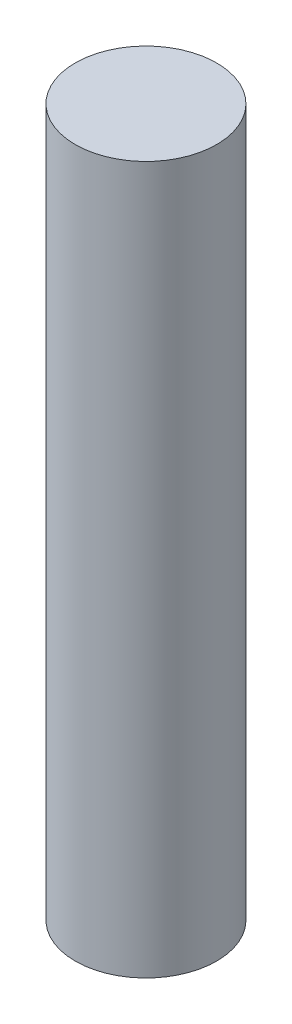
ISO-10303-21;
HEADER;
FILE_DESCRIPTION(('STEP AP214'),'2;1');
FILE_NAME('part.step','',(''),(''),'','','');
FILE_SCHEMA(('AUTOMOTIVE_DESIGN { 1 0 10303 214 1 1 1 1 }'));
ENDSEC;
DATA;
#1=APPLICATION_CONTEXT('core data for automotive mechanical design processes');
#2=APPLICATION_PROTOCOL_DEFINITION('international standard','automotive_design',2000,#1);
#3=PRODUCT_CONTEXT('',#1,'mechanical');
#4=PRODUCT('Part','Part','',(#3));
#5=PRODUCT_RELATED_PRODUCT_CATEGORY('part','',(#4));
#6=PRODUCT_DEFINITION_FORMATION('','',#4);
#7=PRODUCT_DEFINITION_CONTEXT('part definition',#1,'design');
#8=PRODUCT_DEFINITION('design','',#6,#7);
#9=PRODUCT_DEFINITION_SHAPE('','',#8);
#10=(LENGTH_UNIT() NAMED_UNIT(*) SI_UNIT(.MILLI.,.METRE.));
#11=(NAMED_UNIT(*) PLANE_ANGLE_UNIT() SI_UNIT($,.RADIAN.));
#12=(NAMED_UNIT(*) SI_UNIT($,.STERADIAN.) SOLID_ANGLE_UNIT());
#13=UNCERTAINTY_MEASURE_WITH_UNIT(LENGTH_MEASURE(1.E-05),#10,'distance_accuracy_value','');
#14=(GEOMETRIC_REPRESENTATION_CONTEXT(3) GLOBAL_UNCERTAINTY_ASSIGNED_CONTEXT((#13)) GLOBAL_UNIT_ASSIGNED_CONTEXT((#10,
#11,#12)) REPRESENTATION_CONTEXT('',''));
#15=CARTESIAN_POINT('',(0.,0.,0.));
#16=DIRECTION('',(0.,0.,1.));
#17=DIRECTION('',(1.,0.,0.));
#18=AXIS2_PLACEMENT_3D('',#15,#16,#17);
#19=CARTESIAN_POINT('',(0.,20.,0.));
#20=DIRECTION('',(0.,-1.,0.));
#21=DIRECTION('',(0.,0.,-1.));
#22=AXIS2_PLACEMENT_3D('',#19,#20,#21);
#23=CYLINDRICAL_SURFACE('',#22,2.);
#24=CARTESIAN_POINT('',(0.,20.,0.));
#25=DIRECTION('',(0.,1.,0.));
#26=DIRECTION('',(0.,0.,1.));
#27=AXIS2_PLACEMENT_3D('',#24,#25,#26);
#28=CIRCLE('',#27,2.);
#29=CARTESIAN_POINT('',(0.,20.,2.));
#30=VERTEX_POINT('',#29);
#31=EDGE_CURVE('E10',#30,#30,#28,.T.);
#32=ORIENTED_EDGE('',*,*,#31,.F.);
#33=EDGE_LOOP('',(#32));
#34=FACE_BOUND('',#33,.T.);
#35=CARTESIAN_POINT('',(0.,0.,0.));
#36=DIRECTION('',(0.,1.,0.));
#37=DIRECTION('',(0.,0.,1.));
#38=AXIS2_PLACEMENT_3D('',#35,#36,#37);
#39=CIRCLE('',#38,2.);
#40=CARTESIAN_POINT('',(0.,0.,2.));
#41=VERTEX_POINT('',#40);
#42=EDGE_CURVE('E34',#41,#41,#39,.T.);
#43=ORIENTED_EDGE('',*,*,#42,.T.);
#44=EDGE_LOOP('',(#43));
#45=FACE_BOUND('',#44,.T.);
#46=ADVANCED_FACE('F31',(#34,#45),#23,.T.);
#47=CARTESIAN_POINT('',(0.,20.,0.));
#48=DIRECTION('',(0.,1.,0.));
#49=DIRECTION('',(0.,0.,1.));
#50=AXIS2_PLACEMENT_3D('',#47,#48,#49);
#51=PLANE('',#50);
#52=ORIENTED_EDGE('',*,*,#31,.T.);
#53=EDGE_LOOP('',(#52));
#54=FACE_BOUND('',#53,.T.);
#55=ADVANCED_FACE('F46',(#54),#51,.T.);
#56=CARTESIAN_POINT('',(0.,0.,0.));
#57=DIRECTION('',(0.,1.,0.));
#58=DIRECTION('',(0.,0.,1.));
#59=AXIS2_PLACEMENT_3D('',#56,#57,#58);
#60=PLANE('',#59);
#61=ORIENTED_EDGE('',*,*,#42,.F.);
#62=EDGE_LOOP('',(#61));
#63=FACE_BOUND('',#62,.T.);
#64=ADVANCED_FACE('F44',(#63),#60,.F.);
#65=CLOSED_SHELL('',(#46,#55,#64));
#66=MANIFOLD_SOLID_BREP('B2',#65);
#67=ADVANCED_BREP_SHAPE_REPRESENTATION('',(#18,#66),#14);
#68=SHAPE_DEFINITION_REPRESENTATION(#9,#67);
ENDSEC;
END-ISO-10303-21;
